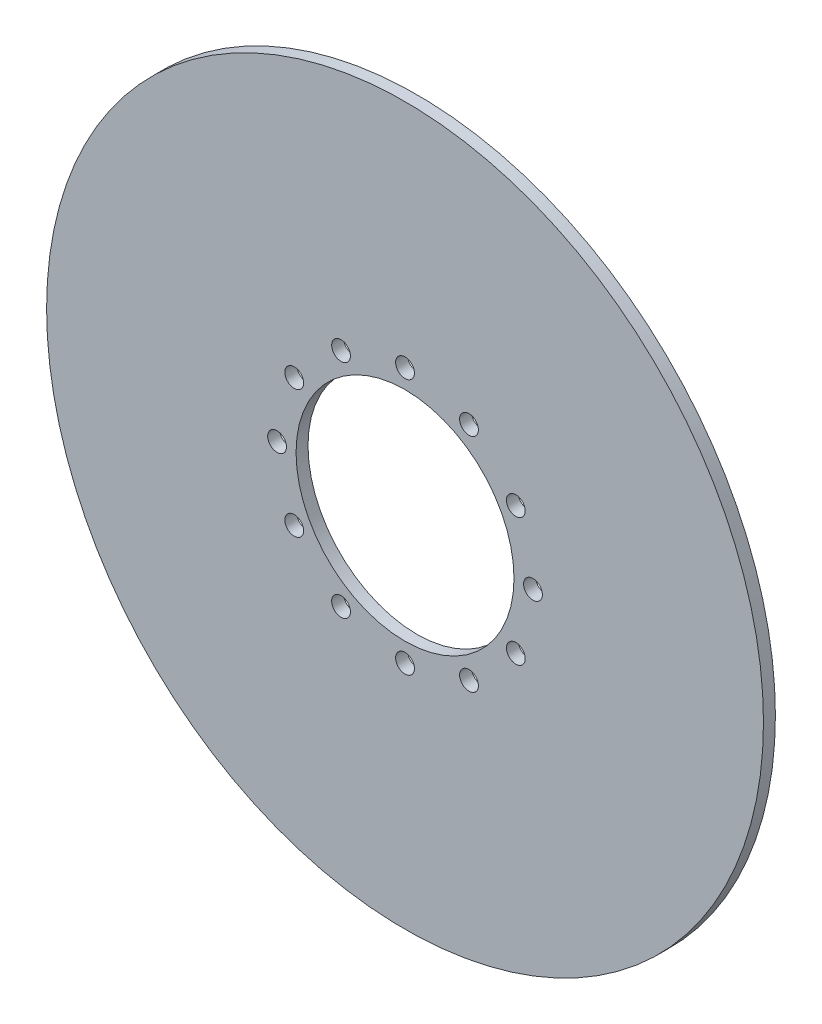
ISO-10303-21;
HEADER;
FILE_DESCRIPTION(('STEP AP214'),'2;1');
FILE_NAME('part.step','',(''),(''),'','','');
FILE_SCHEMA(('AUTOMOTIVE_DESIGN { 1 0 10303 214 1 1 1 1 }'));
ENDSEC;
DATA;
#1=APPLICATION_CONTEXT('core data for automotive mechanical design processes');
#2=APPLICATION_PROTOCOL_DEFINITION('international standard','automotive_design',2000,#1);
#3=PRODUCT_CONTEXT('',#1,'mechanical');
#4=PRODUCT('Part','Part','',(#3));
#5=PRODUCT_RELATED_PRODUCT_CATEGORY('part','',(#4));
#6=PRODUCT_DEFINITION_FORMATION('','',#4);
#7=PRODUCT_DEFINITION_CONTEXT('part definition',#1,'design');
#8=PRODUCT_DEFINITION('design','',#6,#7);
#9=PRODUCT_DEFINITION_SHAPE('','',#8);
#10=(LENGTH_UNIT() NAMED_UNIT(*) SI_UNIT(.MILLI.,.METRE.));
#11=(NAMED_UNIT(*) PLANE_ANGLE_UNIT() SI_UNIT($,.RADIAN.));
#12=(NAMED_UNIT(*) SI_UNIT($,.STERADIAN.) SOLID_ANGLE_UNIT());
#13=UNCERTAINTY_MEASURE_WITH_UNIT(LENGTH_MEASURE(1.E-05),#10,'distance_accuracy_value','');
#14=(GEOMETRIC_REPRESENTATION_CONTEXT(3) GLOBAL_UNCERTAINTY_ASSIGNED_CONTEXT((#13)) GLOBAL_UNIT_ASSIGNED_CONTEXT((#10,
#11,#12)) REPRESENTATION_CONTEXT('',''));
#15=CARTESIAN_POINT('',(0.,0.,0.));
#16=DIRECTION('',(0.,0.,1.));
#17=DIRECTION('',(1.,0.,0.));
#18=AXIS2_PLACEMENT_3D('',#15,#16,#17);
#19=CARTESIAN_POINT('',(0.,0.,3.175));
#20=DIRECTION('',(0.,0.,1.));
#21=DIRECTION('',(1.,0.,0.));
#22=AXIS2_PLACEMENT_3D('',#19,#20,#21);
#23=PLANE('',#22);
#24=CARTESIAN_POINT('',(-29.4448637286702,16.9999999999987,3.175));
#25=DIRECTION('',(0.,0.,1.));
#26=DIRECTION('',(1.,0.,0.));
#27=AXIS2_PLACEMENT_3D('',#24,#25,#26);
#28=CIRCLE('',#27,2.49698906987796);
#29=CARTESIAN_POINT('',(-26.9478746587923,16.9999999999987,3.175));
#30=VERTEX_POINT('',#29);
#31=EDGE_CURVE('E113',#30,#30,#28,.T.);
#32=ORIENTED_EDGE('',*,*,#31,.F.);
#33=EDGE_LOOP('',(#32));
#34=FACE_BOUND('',#33,.T.);
#35=CARTESIAN_POINT('',(-29.4448637286688,-17.0000000000013,3.175));
#36=DIRECTION('',(0.,0.,1.));
#37=DIRECTION('',(1.,0.,0.));
#38=AXIS2_PLACEMENT_3D('',#35,#36,#37);
#39=CIRCLE('',#38,2.49698906987796);
#40=CARTESIAN_POINT('',(-26.9478746587908,-17.0000000000013,3.175));
#41=VERTEX_POINT('',#40);
#42=EDGE_CURVE('E101',#41,#41,#39,.T.);
#43=ORIENTED_EDGE('',*,*,#42,.F.);
#44=EDGE_LOOP('',(#43));
#45=FACE_BOUND('',#44,.T.);
#46=CARTESIAN_POINT('',(2.86804195578331E-12,-34.,3.175));
#47=DIRECTION('',(0.,0.,1.));
#48=DIRECTION('',(1.,0.,0.));
#49=AXIS2_PLACEMENT_3D('',#46,#47,#48);
#50=CIRCLE('',#49,2.49698906987796);
#51=CARTESIAN_POINT('',(2.49698906988083,-34.,3.175));
#52=VERTEX_POINT('',#51);
#53=EDGE_CURVE('E89',#52,#52,#50,.T.);
#54=ORIENTED_EDGE('',*,*,#53,.F.);
#55=EDGE_LOOP('',(#54));
#56=FACE_BOUND('',#55,.T.);
#57=CARTESIAN_POINT('',(29.4448637286731,-16.9999999999988,3.175));
#58=DIRECTION('',(0.,0.,1.));
#59=DIRECTION('',(1.,0.,0.));
#60=AXIS2_PLACEMENT_3D('',#57,#58,#59);
#61=CIRCLE('',#60,2.49698906987769);
#62=CARTESIAN_POINT('',(31.9418527985508,-16.9999999999988,3.175));
#63=VERTEX_POINT('',#62);
#64=EDGE_CURVE('E77',#63,#63,#61,.T.);
#65=ORIENTED_EDGE('',*,*,#64,.F.);
#66=EDGE_LOOP('',(#65));
#67=FACE_BOUND('',#66,.T.);
#68=CARTESIAN_POINT('',(29.4448637286716,17.0000000000012,3.175));
#69=DIRECTION('',(0.,0.,1.));
#70=DIRECTION('',(1.,0.,0.));
#71=AXIS2_PLACEMENT_3D('',#68,#69,#70);
#72=CIRCLE('',#71,2.49698906987796);
#73=CARTESIAN_POINT('',(31.9418527985496,17.0000000000012,3.175));
#74=VERTEX_POINT('',#73);
#75=EDGE_CURVE('E65',#74,#74,#72,.T.);
#76=ORIENTED_EDGE('',*,*,#75,.F.);
#77=EDGE_LOOP('',(#76));
#78=FACE_BOUND('',#77,.T.);
#79=CARTESIAN_POINT('',(0.,34.,3.175));
#80=DIRECTION('',(0.,0.,1.));
#81=DIRECTION('',(1.,0.,0.));
#82=AXIS2_PLACEMENT_3D('',#79,#80,#81);
#83=CIRCLE('',#82,2.49698906987796);
#84=CARTESIAN_POINT('',(2.49698906987796,34.,3.175));
#85=VERTEX_POINT('',#84);
#86=EDGE_CURVE('E53',#85,#85,#83,.T.);
#87=ORIENTED_EDGE('',*,*,#86,.F.);
#88=EDGE_LOOP('',(#87));
#89=FACE_BOUND('',#88,.T.);
#90=CARTESIAN_POINT('',(0.,0.,3.175));
#91=DIRECTION('',(0.,0.,1.));
#92=DIRECTION('',(1.,0.,0.));
#93=AXIS2_PLACEMENT_3D('',#90,#91,#92);
#94=CIRCLE('',#93,95.25);
#95=CARTESIAN_POINT('',(95.25,0.,3.175));
#96=VERTEX_POINT('',#95);
#97=EDGE_CURVE('E10',#96,#96,#94,.T.);
#98=ORIENTED_EDGE('',*,*,#97,.T.);
#99=EDGE_LOOP('',(#98));
#100=FACE_BOUND('',#99,.T.);
#101=CARTESIAN_POINT('',(0.,0.,3.175));
#102=DIRECTION('',(0.,0.,1.));
#103=DIRECTION('',(1.,0.,0.));
#104=AXIS2_PLACEMENT_3D('',#101,#102,#103);
#105=CIRCLE('',#104,28.956);
#106=CARTESIAN_POINT('',(28.956,0.,3.175));
#107=VERTEX_POINT('',#106);
#108=EDGE_CURVE('E48',#107,#107,#105,.T.);
#109=ORIENTED_EDGE('',*,*,#108,.F.);
#110=EDGE_LOOP('',(#109));
#111=FACE_BOUND('',#110,.T.);
#112=CARTESIAN_POINT('',(17.0000000000002,29.4448637286716,3.175));
#113=DIRECTION('',(0.,0.,1.));
#114=DIRECTION('',(1.,0.,0.));
#115=AXIS2_PLACEMENT_3D('',#112,#113,#114);
#116=CIRCLE('',#115,2.49698906987796);
#117=CARTESIAN_POINT('',(19.4969890698782,29.4448637286716,3.175));
#118=VERTEX_POINT('',#117);
#119=EDGE_CURVE('E59',#118,#118,#116,.T.);
#120=ORIENTED_EDGE('',*,*,#119,.F.);
#121=EDGE_LOOP('',(#120));
#122=FACE_BOUND('',#121,.T.);
#123=CARTESIAN_POINT('',(34.0000000000014,1.43402097789165E-12,3.175));
#124=DIRECTION('',(0.,0.,1.));
#125=DIRECTION('',(1.,0.,0.));
#126=AXIS2_PLACEMENT_3D('',#123,#124,#125);
#127=CIRCLE('',#126,2.49698906987796);
#128=CARTESIAN_POINT('',(36.4969890698794,1.43402097789165E-12,3.175));
#129=VERTEX_POINT('',#128);
#130=EDGE_CURVE('E71',#129,#129,#127,.T.);
#131=ORIENTED_EDGE('',*,*,#130,.F.);
#132=EDGE_LOOP('',(#131));
#133=FACE_BOUND('',#132,.T.);
#134=CARTESIAN_POINT('',(17.0000000000027,-29.4448637286702,3.175));
#135=DIRECTION('',(0.,0.,1.));
#136=DIRECTION('',(1.,0.,0.));
#137=AXIS2_PLACEMENT_3D('',#134,#135,#136);
#138=CIRCLE('',#137,2.49698906987837);
#139=CARTESIAN_POINT('',(19.4969890698811,-29.4448637286702,3.175));
#140=VERTEX_POINT('',#139);
#141=EDGE_CURVE('E83',#140,#140,#138,.T.);
#142=ORIENTED_EDGE('',*,*,#141,.F.);
#143=EDGE_LOOP('',(#142));
#144=FACE_BOUND('',#143,.T.);
#145=CARTESIAN_POINT('',(-16.9999999999973,-29.4448637286716,3.175));
#146=DIRECTION('',(0.,0.,1.));
#147=DIRECTION('',(1.,0.,0.));
#148=AXIS2_PLACEMENT_3D('',#145,#146,#147);
#149=CIRCLE('',#148,2.49698906987796);
#150=CARTESIAN_POINT('',(-14.5030109301194,-29.4448637286716,3.175));
#151=VERTEX_POINT('',#150);
#152=EDGE_CURVE('E95',#151,#151,#149,.T.);
#153=ORIENTED_EDGE('',*,*,#152,.F.);
#154=EDGE_LOOP('',(#153));
#155=FACE_BOUND('',#154,.T.);
#156=CARTESIAN_POINT('',(-33.9999999999986,-1.43818477700875E-12,3.175));
#157=DIRECTION('',(0.,0.,1.));
#158=DIRECTION('',(1.,0.,0.));
#159=AXIS2_PLACEMENT_3D('',#156,#157,#158);
#160=CIRCLE('',#159,2.49698906987796);
#161=CARTESIAN_POINT('',(-31.5030109301206,-1.43818477700875E-12,3.175));
#162=VERTEX_POINT('',#161);
#163=EDGE_CURVE('E107',#162,#162,#160,.T.);
#164=ORIENTED_EDGE('',*,*,#163,.F.);
#165=EDGE_LOOP('',(#164));
#166=FACE_BOUND('',#165,.T.);
#167=CARTESIAN_POINT('',(-16.9999999999998,29.4448637286702,3.175));
#168=DIRECTION('',(0.,0.,1.));
#169=DIRECTION('',(1.,0.,0.));
#170=AXIS2_PLACEMENT_3D('',#167,#168,#169);
#171=CIRCLE('',#170,2.49698906987796);
#172=CARTESIAN_POINT('',(-14.5030109301219,29.4448637286702,3.175));
#173=VERTEX_POINT('',#172);
#174=EDGE_CURVE('E119',#173,#173,#171,.T.);
#175=ORIENTED_EDGE('',*,*,#174,.F.);
#176=EDGE_LOOP('',(#175));
#177=FACE_BOUND('',#176,.T.);
#178=ADVANCED_FACE('F37',(#34,#45,#56,#67,#78,#89,#100,#111,#122,#133,#144,#155,#166,#177),#23,.T.);
#179=CARTESIAN_POINT('',(0.,0.,0.));
#180=DIRECTION('',(0.,0.,1.));
#181=DIRECTION('',(1.,0.,0.));
#182=AXIS2_PLACEMENT_3D('',#179,#180,#181);
#183=PLANE('',#182);
#184=CARTESIAN_POINT('',(0.,0.,0.));
#185=DIRECTION('',(0.,0.,1.));
#186=DIRECTION('',(1.,0.,0.));
#187=AXIS2_PLACEMENT_3D('',#184,#185,#186);
#188=CIRCLE('',#187,95.25);
#189=CARTESIAN_POINT('',(95.25,0.,0.));
#190=VERTEX_POINT('',#189);
#191=EDGE_CURVE('E41',#190,#190,#188,.T.);
#192=ORIENTED_EDGE('',*,*,#191,.F.);
#193=EDGE_LOOP('',(#192));
#194=FACE_BOUND('',#193,.T.);
#195=CARTESIAN_POINT('',(0.,0.,0.));
#196=DIRECTION('',(0.,0.,1.));
#197=DIRECTION('',(1.,0.,0.));
#198=AXIS2_PLACEMENT_3D('',#195,#196,#197);
#199=CIRCLE('',#198,28.956);
#200=CARTESIAN_POINT('',(28.956,0.,0.));
#201=VERTEX_POINT('',#200);
#202=EDGE_CURVE('E50',#201,#201,#199,.T.);
#203=ORIENTED_EDGE('',*,*,#202,.T.);
#204=EDGE_LOOP('',(#203));
#205=FACE_BOUND('',#204,.T.);
#206=CARTESIAN_POINT('',(0.,34.,0.));
#207=DIRECTION('',(0.,0.,1.));
#208=DIRECTION('',(1.,0.,0.));
#209=AXIS2_PLACEMENT_3D('',#206,#207,#208);
#210=CIRCLE('',#209,2.49698906987796);
#211=CARTESIAN_POINT('',(2.49698906987796,34.,0.));
#212=VERTEX_POINT('',#211);
#213=EDGE_CURVE('E56',#212,#212,#210,.T.);
#214=ORIENTED_EDGE('',*,*,#213,.T.);
#215=EDGE_LOOP('',(#214));
#216=FACE_BOUND('',#215,.T.);
#217=CARTESIAN_POINT('',(17.0000000000002,29.4448637286716,0.));
#218=DIRECTION('',(0.,0.,1.));
#219=DIRECTION('',(1.,0.,0.));
#220=AXIS2_PLACEMENT_3D('',#217,#218,#219);
#221=CIRCLE('',#220,2.49698906987796);
#222=CARTESIAN_POINT('',(19.4969890698782,29.4448637286716,0.));
#223=VERTEX_POINT('',#222);
#224=EDGE_CURVE('E62',#223,#223,#221,.T.);
#225=ORIENTED_EDGE('',*,*,#224,.T.);
#226=EDGE_LOOP('',(#225));
#227=FACE_BOUND('',#226,.T.);
#228=CARTESIAN_POINT('',(29.4448637286716,17.0000000000012,0.));
#229=DIRECTION('',(0.,0.,1.));
#230=DIRECTION('',(1.,0.,0.));
#231=AXIS2_PLACEMENT_3D('',#228,#229,#230);
#232=CIRCLE('',#231,2.49698906987796);
#233=CARTESIAN_POINT('',(31.9418527985496,17.0000000000012,0.));
#234=VERTEX_POINT('',#233);
#235=EDGE_CURVE('E68',#234,#234,#232,.T.);
#236=ORIENTED_EDGE('',*,*,#235,.T.);
#237=EDGE_LOOP('',(#236));
#238=FACE_BOUND('',#237,.T.);
#239=CARTESIAN_POINT('',(34.0000000000014,1.43402097789165E-12,0.));
#240=DIRECTION('',(0.,0.,1.));
#241=DIRECTION('',(1.,0.,0.));
#242=AXIS2_PLACEMENT_3D('',#239,#240,#241);
#243=CIRCLE('',#242,2.49698906987796);
#244=CARTESIAN_POINT('',(36.4969890698794,1.43402097789165E-12,0.));
#245=VERTEX_POINT('',#244);
#246=EDGE_CURVE('E74',#245,#245,#243,.T.);
#247=ORIENTED_EDGE('',*,*,#246,.T.);
#248=EDGE_LOOP('',(#247));
#249=FACE_BOUND('',#248,.T.);
#250=CARTESIAN_POINT('',(29.4448637286731,-16.9999999999988,0.));
#251=DIRECTION('',(0.,0.,1.));
#252=DIRECTION('',(1.,0.,0.));
#253=AXIS2_PLACEMENT_3D('',#250,#251,#252);
#254=CIRCLE('',#253,2.49698906987769);
#255=CARTESIAN_POINT('',(31.9418527985508,-16.9999999999988,0.));
#256=VERTEX_POINT('',#255);
#257=EDGE_CURVE('E80',#256,#256,#254,.T.);
#258=ORIENTED_EDGE('',*,*,#257,.T.);
#259=EDGE_LOOP('',(#258));
#260=FACE_BOUND('',#259,.T.);
#261=CARTESIAN_POINT('',(17.0000000000027,-29.4448637286702,0.));
#262=DIRECTION('',(0.,0.,1.));
#263=DIRECTION('',(1.,0.,0.));
#264=AXIS2_PLACEMENT_3D('',#261,#262,#263);
#265=CIRCLE('',#264,2.49698906987837);
#266=CARTESIAN_POINT('',(19.4969890698811,-29.4448637286702,0.));
#267=VERTEX_POINT('',#266);
#268=EDGE_CURVE('E86',#267,#267,#265,.T.);
#269=ORIENTED_EDGE('',*,*,#268,.T.);
#270=EDGE_LOOP('',(#269));
#271=FACE_BOUND('',#270,.T.);
#272=CARTESIAN_POINT('',(2.86804195578331E-12,-34.,0.));
#273=DIRECTION('',(0.,0.,1.));
#274=DIRECTION('',(1.,0.,0.));
#275=AXIS2_PLACEMENT_3D('',#272,#273,#274);
#276=CIRCLE('',#275,2.49698906987796);
#277=CARTESIAN_POINT('',(2.49698906988083,-34.,0.));
#278=VERTEX_POINT('',#277);
#279=EDGE_CURVE('E92',#278,#278,#276,.T.);
#280=ORIENTED_EDGE('',*,*,#279,.T.);
#281=EDGE_LOOP('',(#280));
#282=FACE_BOUND('',#281,.T.);
#283=CARTESIAN_POINT('',(-16.9999999999973,-29.4448637286716,0.));
#284=DIRECTION('',(0.,0.,1.));
#285=DIRECTION('',(1.,0.,0.));
#286=AXIS2_PLACEMENT_3D('',#283,#284,#285);
#287=CIRCLE('',#286,2.49698906987796);
#288=CARTESIAN_POINT('',(-14.5030109301194,-29.4448637286716,0.));
#289=VERTEX_POINT('',#288);
#290=EDGE_CURVE('E98',#289,#289,#287,.T.);
#291=ORIENTED_EDGE('',*,*,#290,.T.);
#292=EDGE_LOOP('',(#291));
#293=FACE_BOUND('',#292,.T.);
#294=CARTESIAN_POINT('',(-29.4448637286688,-17.0000000000013,0.));
#295=DIRECTION('',(0.,0.,1.));
#296=DIRECTION('',(1.,0.,0.));
#297=AXIS2_PLACEMENT_3D('',#294,#295,#296);
#298=CIRCLE('',#297,2.49698906987796);
#299=CARTESIAN_POINT('',(-26.9478746587908,-17.0000000000013,0.));
#300=VERTEX_POINT('',#299);
#301=EDGE_CURVE('E104',#300,#300,#298,.T.);
#302=ORIENTED_EDGE('',*,*,#301,.T.);
#303=EDGE_LOOP('',(#302));
#304=FACE_BOUND('',#303,.T.);
#305=CARTESIAN_POINT('',(-33.9999999999986,-1.43818477700875E-12,0.));
#306=DIRECTION('',(0.,0.,1.));
#307=DIRECTION('',(1.,0.,0.));
#308=AXIS2_PLACEMENT_3D('',#305,#306,#307);
#309=CIRCLE('',#308,2.49698906987796);
#310=CARTESIAN_POINT('',(-31.5030109301206,-1.43818477700875E-12,0.));
#311=VERTEX_POINT('',#310);
#312=EDGE_CURVE('E110',#311,#311,#309,.T.);
#313=ORIENTED_EDGE('',*,*,#312,.T.);
#314=EDGE_LOOP('',(#313));
#315=FACE_BOUND('',#314,.T.);
#316=CARTESIAN_POINT('',(-29.4448637286702,16.9999999999987,0.));
#317=DIRECTION('',(0.,0.,1.));
#318=DIRECTION('',(1.,0.,0.));
#319=AXIS2_PLACEMENT_3D('',#316,#317,#318);
#320=CIRCLE('',#319,2.49698906987796);
#321=CARTESIAN_POINT('',(-26.9478746587923,16.9999999999987,0.));
#322=VERTEX_POINT('',#321);
#323=EDGE_CURVE('E116',#322,#322,#320,.T.);
#324=ORIENTED_EDGE('',*,*,#323,.T.);
#325=EDGE_LOOP('',(#324));
#326=FACE_BOUND('',#325,.T.);
#327=CARTESIAN_POINT('',(-16.9999999999998,29.4448637286702,0.));
#328=DIRECTION('',(0.,0.,1.));
#329=DIRECTION('',(1.,0.,0.));
#330=AXIS2_PLACEMENT_3D('',#327,#328,#329);
#331=CIRCLE('',#330,2.49698906987796);
#332=CARTESIAN_POINT('',(-14.5030109301219,29.4448637286702,0.));
#333=VERTEX_POINT('',#332);
#334=EDGE_CURVE('E122',#333,#333,#331,.T.);
#335=ORIENTED_EDGE('',*,*,#334,.T.);
#336=EDGE_LOOP('',(#335));
#337=FACE_BOUND('',#336,.T.);
#338=ADVANCED_FACE('F132',(#194,#205,#216,#227,#238,#249,#260,#271,#282,#293,#304,#315,#326,
#337),#183,.F.);
#339=CARTESIAN_POINT('',(0.,0.,3.175));
#340=DIRECTION('',(0.,0.,-1.));
#341=DIRECTION('',(-1.,0.,0.));
#342=AXIS2_PLACEMENT_3D('',#339,#340,#341);
#343=CYLINDRICAL_SURFACE('',#342,95.25);
#344=ORIENTED_EDGE('',*,*,#97,.F.);
#345=EDGE_LOOP('',(#344));
#346=FACE_BOUND('',#345,.T.);
#347=ORIENTED_EDGE('',*,*,#191,.T.);
#348=EDGE_LOOP('',(#347));
#349=FACE_BOUND('',#348,.T.);
#350=ADVANCED_FACE('F39',(#346,#349),#343,.T.);
#351=CARTESIAN_POINT('',(0.,0.,3.175));
#352=DIRECTION('',(0.,0.,-1.));
#353=DIRECTION('',(-1.,0.,0.));
#354=AXIS2_PLACEMENT_3D('',#351,#352,#353);
#355=CYLINDRICAL_SURFACE('',#354,28.956);
#356=ORIENTED_EDGE('',*,*,#108,.T.);
#357=EDGE_LOOP('',(#356));
#358=FACE_BOUND('',#357,.T.);
#359=ORIENTED_EDGE('',*,*,#202,.F.);
#360=EDGE_LOOP('',(#359));
#361=FACE_BOUND('',#360,.T.);
#362=ADVANCED_FACE('F142',(#358,#361),#355,.F.);
#363=CARTESIAN_POINT('',(0.,34.,3.175));
#364=DIRECTION('',(0.,0.,-1.));
#365=DIRECTION('',(-1.,0.,0.));
#366=AXIS2_PLACEMENT_3D('',#363,#364,#365);
#367=CYLINDRICAL_SURFACE('',#366,2.49698906987796);
#368=ORIENTED_EDGE('',*,*,#86,.T.);
#369=EDGE_LOOP('',(#368));
#370=FACE_BOUND('',#369,.T.);
#371=ORIENTED_EDGE('',*,*,#213,.F.);
#372=EDGE_LOOP('',(#371));
#373=FACE_BOUND('',#372,.T.);
#374=ADVANCED_FACE('F145',(#370,#373),#367,.F.);
#375=CARTESIAN_POINT('',(17.0000000000002,29.4448637286716,3.175));
#376=DIRECTION('',(0.,0.,-1.));
#377=DIRECTION('',(-1.,0.,0.));
#378=AXIS2_PLACEMENT_3D('',#375,#376,#377);
#379=CYLINDRICAL_SURFACE('',#378,2.49698906987796);
#380=ORIENTED_EDGE('',*,*,#119,.T.);
#381=EDGE_LOOP('',(#380));
#382=FACE_BOUND('',#381,.T.);
#383=ORIENTED_EDGE('',*,*,#224,.F.);
#384=EDGE_LOOP('',(#383));
#385=FACE_BOUND('',#384,.T.);
#386=ADVANCED_FACE('F149',(#382,#385),#379,.F.);
#387=CARTESIAN_POINT('',(29.4448637286716,17.0000000000012,3.175));
#388=DIRECTION('',(0.,0.,-1.));
#389=DIRECTION('',(-1.,0.,0.));
#390=AXIS2_PLACEMENT_3D('',#387,#388,#389);
#391=CYLINDRICAL_SURFACE('',#390,2.49698906987796);
#392=ORIENTED_EDGE('',*,*,#75,.T.);
#393=EDGE_LOOP('',(#392));
#394=FACE_BOUND('',#393,.T.);
#395=ORIENTED_EDGE('',*,*,#235,.F.);
#396=EDGE_LOOP('',(#395));
#397=FACE_BOUND('',#396,.T.);
#398=ADVANCED_FACE('F153',(#394,#397),#391,.F.);
#399=CARTESIAN_POINT('',(34.0000000000014,1.43402097789165E-12,3.175));
#400=DIRECTION('',(0.,0.,-1.));
#401=DIRECTION('',(-1.,0.,0.));
#402=AXIS2_PLACEMENT_3D('',#399,#400,#401);
#403=CYLINDRICAL_SURFACE('',#402,2.49698906987796);
#404=ORIENTED_EDGE('',*,*,#130,.T.);
#405=EDGE_LOOP('',(#404));
#406=FACE_BOUND('',#405,.T.);
#407=ORIENTED_EDGE('',*,*,#246,.F.);
#408=EDGE_LOOP('',(#407));
#409=FACE_BOUND('',#408,.T.);
#410=ADVANCED_FACE('F157',(#406,#409),#403,.F.);
#411=CARTESIAN_POINT('',(29.4448637286731,-16.9999999999988,3.175));
#412=DIRECTION('',(0.,0.,-1.));
#413=DIRECTION('',(-1.,0.,0.));
#414=AXIS2_PLACEMENT_3D('',#411,#412,#413);
#415=CYLINDRICAL_SURFACE('',#414,2.49698906987769);
#416=ORIENTED_EDGE('',*,*,#64,.T.);
#417=EDGE_LOOP('',(#416));
#418=FACE_BOUND('',#417,.T.);
#419=ORIENTED_EDGE('',*,*,#257,.F.);
#420=EDGE_LOOP('',(#419));
#421=FACE_BOUND('',#420,.T.);
#422=ADVANCED_FACE('F161',(#418,#421),#415,.F.);
#423=CARTESIAN_POINT('',(17.0000000000027,-29.4448637286702,3.175));
#424=DIRECTION('',(0.,0.,-1.));
#425=DIRECTION('',(-1.,0.,0.));
#426=AXIS2_PLACEMENT_3D('',#423,#424,#425);
#427=CYLINDRICAL_SURFACE('',#426,2.49698906987837);
#428=ORIENTED_EDGE('',*,*,#141,.T.);
#429=EDGE_LOOP('',(#428));
#430=FACE_BOUND('',#429,.T.);
#431=ORIENTED_EDGE('',*,*,#268,.F.);
#432=EDGE_LOOP('',(#431));
#433=FACE_BOUND('',#432,.T.);
#434=ADVANCED_FACE('F165',(#430,#433),#427,.F.);
#435=CARTESIAN_POINT('',(2.86804195578331E-12,-34.,3.175));
#436=DIRECTION('',(0.,0.,-1.));
#437=DIRECTION('',(-1.,0.,0.));
#438=AXIS2_PLACEMENT_3D('',#435,#436,#437);
#439=CYLINDRICAL_SURFACE('',#438,2.49698906987796);
#440=ORIENTED_EDGE('',*,*,#53,.T.);
#441=EDGE_LOOP('',(#440));
#442=FACE_BOUND('',#441,.T.);
#443=ORIENTED_EDGE('',*,*,#279,.F.);
#444=EDGE_LOOP('',(#443));
#445=FACE_BOUND('',#444,.T.);
#446=ADVANCED_FACE('F169',(#442,#445),#439,.F.);
#447=CARTESIAN_POINT('',(-16.9999999999973,-29.4448637286716,3.175));
#448=DIRECTION('',(0.,0.,-1.));
#449=DIRECTION('',(-1.,0.,0.));
#450=AXIS2_PLACEMENT_3D('',#447,#448,#449);
#451=CYLINDRICAL_SURFACE('',#450,2.49698906987796);
#452=ORIENTED_EDGE('',*,*,#152,.T.);
#453=EDGE_LOOP('',(#452));
#454=FACE_BOUND('',#453,.T.);
#455=ORIENTED_EDGE('',*,*,#290,.F.);
#456=EDGE_LOOP('',(#455));
#457=FACE_BOUND('',#456,.T.);
#458=ADVANCED_FACE('F173',(#454,#457),#451,.F.);
#459=CARTESIAN_POINT('',(-29.4448637286688,-17.0000000000013,3.175));
#460=DIRECTION('',(0.,0.,-1.));
#461=DIRECTION('',(-1.,0.,0.));
#462=AXIS2_PLACEMENT_3D('',#459,#460,#461);
#463=CYLINDRICAL_SURFACE('',#462,2.49698906987796);
#464=ORIENTED_EDGE('',*,*,#42,.T.);
#465=EDGE_LOOP('',(#464));
#466=FACE_BOUND('',#465,.T.);
#467=ORIENTED_EDGE('',*,*,#301,.F.);
#468=EDGE_LOOP('',(#467));
#469=FACE_BOUND('',#468,.T.);
#470=ADVANCED_FACE('F177',(#466,#469),#463,.F.);
#471=CARTESIAN_POINT('',(-33.9999999999986,-1.43818477700875E-12,3.175));
#472=DIRECTION('',(0.,0.,-1.));
#473=DIRECTION('',(-1.,0.,0.));
#474=AXIS2_PLACEMENT_3D('',#471,#472,#473);
#475=CYLINDRICAL_SURFACE('',#474,2.49698906987796);
#476=ORIENTED_EDGE('',*,*,#163,.T.);
#477=EDGE_LOOP('',(#476));
#478=FACE_BOUND('',#477,.T.);
#479=ORIENTED_EDGE('',*,*,#312,.F.);
#480=EDGE_LOOP('',(#479));
#481=FACE_BOUND('',#480,.T.);
#482=ADVANCED_FACE('F181',(#478,#481),#475,.F.);
#483=CARTESIAN_POINT('',(-29.4448637286702,16.9999999999987,3.175));
#484=DIRECTION('',(0.,0.,-1.));
#485=DIRECTION('',(-1.,0.,0.));
#486=AXIS2_PLACEMENT_3D('',#483,#484,#485);
#487=CYLINDRICAL_SURFACE('',#486,2.49698906987796);
#488=ORIENTED_EDGE('',*,*,#31,.T.);
#489=EDGE_LOOP('',(#488));
#490=FACE_BOUND('',#489,.T.);
#491=ORIENTED_EDGE('',*,*,#323,.F.);
#492=EDGE_LOOP('',(#491));
#493=FACE_BOUND('',#492,.T.);
#494=ADVANCED_FACE('F185',(#490,#493),#487,.F.);
#495=CARTESIAN_POINT('',(-16.9999999999998,29.4448637286702,3.175));
#496=DIRECTION('',(0.,0.,-1.));
#497=DIRECTION('',(-1.,0.,0.));
#498=AXIS2_PLACEMENT_3D('',#495,#496,#497);
#499=CYLINDRICAL_SURFACE('',#498,2.49698906987796);
#500=ORIENTED_EDGE('',*,*,#174,.T.);
#501=EDGE_LOOP('',(#500));
#502=FACE_BOUND('',#501,.T.);
#503=ORIENTED_EDGE('',*,*,#334,.F.);
#504=EDGE_LOOP('',(#503));
#505=FACE_BOUND('',#504,.T.);
#506=ADVANCED_FACE('F128',(#502,#505),#499,.F.);
#507=CLOSED_SHELL('',(#178,#338,#350,#362,#374,#386,#398,#410,#422,#434,#446,#458,#470,#482,
#494,#506));
#508=MANIFOLD_SOLID_BREP('B2',#507);
#509=ADVANCED_BREP_SHAPE_REPRESENTATION('',(#18,#508),#14);
#510=SHAPE_DEFINITION_REPRESENTATION(#9,#509);
ENDSEC;
END-ISO-10303-21;
